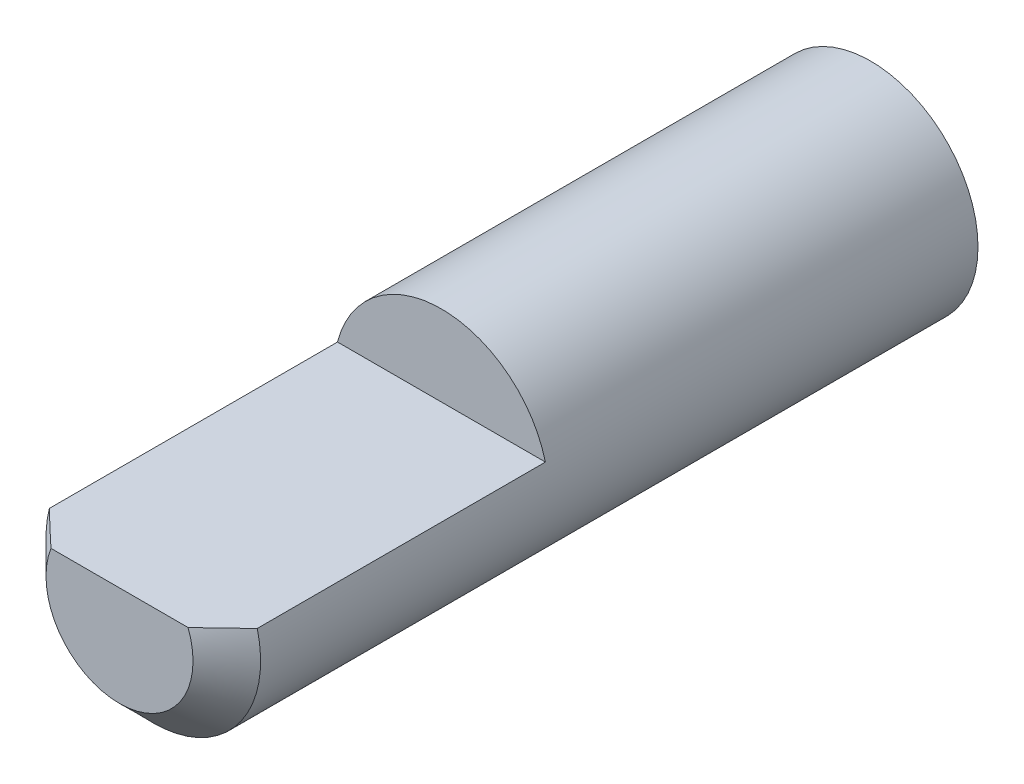
ISO-10303-21;
HEADER;
FILE_DESCRIPTION(('STEP AP214'),'2;1');
FILE_NAME('part.step','',(''),(''),'','','');
FILE_SCHEMA(('AUTOMOTIVE_DESIGN { 1 0 10303 214 1 1 1 1 }'));
ENDSEC;
DATA;
#1=APPLICATION_CONTEXT('core data for automotive mechanical design processes');
#2=APPLICATION_PROTOCOL_DEFINITION('international standard','automotive_design',2000,#1);
#3=PRODUCT_CONTEXT('',#1,'mechanical');
#4=PRODUCT('Part','Part','',(#3));
#5=PRODUCT_RELATED_PRODUCT_CATEGORY('part','',(#4));
#6=PRODUCT_DEFINITION_FORMATION('','',#4);
#7=PRODUCT_DEFINITION_CONTEXT('part definition',#1,'design');
#8=PRODUCT_DEFINITION('design','',#6,#7);
#9=PRODUCT_DEFINITION_SHAPE('','',#8);
#10=(LENGTH_UNIT() NAMED_UNIT(*) SI_UNIT(.MILLI.,.METRE.));
#11=(NAMED_UNIT(*) PLANE_ANGLE_UNIT() SI_UNIT($,.RADIAN.));
#12=(NAMED_UNIT(*) SI_UNIT($,.STERADIAN.) SOLID_ANGLE_UNIT());
#13=UNCERTAINTY_MEASURE_WITH_UNIT(LENGTH_MEASURE(1.E-05),#10,'distance_accuracy_value','');
#14=(GEOMETRIC_REPRESENTATION_CONTEXT(3) GLOBAL_UNCERTAINTY_ASSIGNED_CONTEXT((#13)) GLOBAL_UNIT_ASSIGNED_CONTEXT((#10,
#11,#12)) REPRESENTATION_CONTEXT('',''));
#15=CARTESIAN_POINT('',(0.,0.,0.));
#16=DIRECTION('',(0.,0.,1.));
#17=DIRECTION('',(1.,0.,0.));
#18=AXIS2_PLACEMENT_3D('',#15,#16,#17);
#19=CARTESIAN_POINT('',(0.,0.,22.225));
#20=DIRECTION('',(0.,0.,-1.));
#21=DIRECTION('',(-1.,0.,0.));
#22=AXIS2_PLACEMENT_3D('',#19,#20,#21);
#23=CYLINDRICAL_SURFACE('',#22,3.175);
#24=CARTESIAN_POINT('',(0.,0.,0.));
#25=DIRECTION('',(0.,0.,1.));
#26=DIRECTION('',(1.,0.,0.));
#27=AXIS2_PLACEMENT_3D('',#24,#25,#26);
#28=CIRCLE('',#27,3.175);
#29=CARTESIAN_POINT('',(3.175,0.,0.));
#30=VERTEX_POINT('',#29);
#31=EDGE_CURVE('E83',#30,#30,#28,.T.);
#32=ORIENTED_EDGE('',*,*,#31,.T.);
#33=EDGE_LOOP('',(#32));
#34=FACE_BOUND('',#33,.T.);
#35=DIRECTION('',(0.,0.,-1.));
#36=VECTOR('',#35,1.);
#37=CARTESIAN_POINT('',(3.07581310225443,0.7874,52.1884054149808));
#38=LINE('',#37,#36);
#39=CARTESIAN_POINT('',(3.07581310225443,0.7874,21.225));
#40=VERTEX_POINT('',#39);
#41=CARTESIAN_POINT('',(3.07581310225443,0.7874,12.7));
#42=VERTEX_POINT('',#41);
#43=EDGE_CURVE('E66',#40,#42,#38,.T.);
#44=ORIENTED_EDGE('',*,*,#43,.F.);
#45=CARTESIAN_POINT('',(0.,0.,21.225));
#46=DIRECTION('',(0.,0.,1.));
#47=DIRECTION('',(1.,0.,0.));
#48=AXIS2_PLACEMENT_3D('',#45,#46,#47);
#49=CIRCLE('',#48,3.175);
#50=CARTESIAN_POINT('',(-3.07581310225443,0.7874,21.225));
#51=VERTEX_POINT('',#50);
#52=EDGE_CURVE('E11',#40,#51,#49,.F.);
#53=ORIENTED_EDGE('',*,*,#52,.T.);
#54=DIRECTION('',(0.,0.,-1.));
#55=VECTOR('',#54,1.);
#56=CARTESIAN_POINT('',(-3.07581310225443,0.7874,52.1884054149808));
#57=LINE('',#56,#55);
#58=CARTESIAN_POINT('',(-3.07581310225443,0.7874,12.7));
#59=VERTEX_POINT('',#58);
#60=EDGE_CURVE('E71',#51,#59,#57,.T.);
#61=ORIENTED_EDGE('',*,*,#60,.T.);
#62=CARTESIAN_POINT('',(0.,0.,12.7));
#63=DIRECTION('',(0.,0.,1.));
#64=DIRECTION('',(1.,0.,0.));
#65=AXIS2_PLACEMENT_3D('',#62,#63,#64);
#66=CIRCLE('',#65,3.175);
#67=EDGE_CURVE('E76',#42,#59,#66,.T.);
#68=ORIENTED_EDGE('',*,*,#67,.F.);
#69=EDGE_LOOP('',(#44,#53,#61,#68));
#70=FACE_BOUND('',#69,.T.);
#71=ADVANCED_FACE('F35',(#34,#70),#23,.T.);
#72=CARTESIAN_POINT('',(0.,0.,22.225));
#73=DIRECTION('',(0.,0.,1.));
#74=DIRECTION('',(1.,0.,0.));
#75=AXIS2_PLACEMENT_3D('',#72,#73,#74);
#76=PLANE('',#75);
#77=DIRECTION('',(1.,0.,0.));
#78=VECTOR('',#77,1.);
#79=CARTESIAN_POINT('',(-3.07581310225443,0.7874,22.225));
#80=LINE('',#79,#78);
#81=CARTESIAN_POINT('',(-2.02746793809421,0.7874,22.225));
#82=VERTEX_POINT('',#81);
#83=CARTESIAN_POINT('',(2.02746793809421,0.7874,22.225));
#84=VERTEX_POINT('',#83);
#85=EDGE_CURVE('E81',#82,#84,#80,.T.);
#86=ORIENTED_EDGE('',*,*,#85,.F.);
#87=CARTESIAN_POINT('',(0.,0.,22.225));
#88=DIRECTION('',(0.,0.,1.));
#89=DIRECTION('',(1.,0.,0.));
#90=AXIS2_PLACEMENT_3D('',#87,#88,#89);
#91=CIRCLE('',#90,2.175);
#92=EDGE_CURVE('E86',#82,#84,#91,.T.);
#93=ORIENTED_EDGE('',*,*,#92,.T.);
#94=EDGE_LOOP('',(#86,#93));
#95=FACE_BOUND('',#94,.T.);
#96=ADVANCED_FACE('F104',(#95),#76,.T.);
#97=CARTESIAN_POINT('',(0.,0.,0.));
#98=DIRECTION('',(0.,0.,1.));
#99=DIRECTION('',(1.,0.,0.));
#100=AXIS2_PLACEMENT_3D('',#97,#98,#99);
#101=PLANE('',#100);
#102=ORIENTED_EDGE('',*,*,#31,.F.);
#103=EDGE_LOOP('',(#102));
#104=FACE_BOUND('',#103,.T.);
#105=ADVANCED_FACE('F100',(#104),#101,.F.);
#106=CARTESIAN_POINT('',(-3.07581310225443,0.7874,52.1884054149808));
#107=DIRECTION('',(0.,1.,0.));
#108=DIRECTION('',(0.,0.,1.));
#109=AXIS2_PLACEMENT_3D('',#106,#107,#108);
#110=PLANE('',#109);
#111=ORIENTED_EDGE('',*,*,#85,.T.);
#112=CARTESIAN_POINT('',(2.02746793809421,0.7874,22.225));
#113=CARTESIAN_POINT('',(2.11577280575199,0.7874,22.1426594626641));
#114=CARTESIAN_POINT('',(2.2037513641493,0.7874,22.0599712063815));
#115=CARTESIAN_POINT('',(2.37919847192681,0.7874,21.8940588982848));
#116=CARTESIAN_POINT('',(2.4666670324133,0.7874,21.8108348582222));
#117=CARTESIAN_POINT('',(2.6412396321889,0.7874,21.6440079379049));
#118=CARTESIAN_POINT('',(2.72834367551629,0.7874,21.5604050618686));
#119=CARTESIAN_POINT('',(2.90227010514607,0.7874,21.3929030033339));
#120=CARTESIAN_POINT('',(2.98909248533679,0.7874,21.3090038144873));
#121=CARTESIAN_POINT('',(3.07581310225443,0.7874,21.225));
#122=B_SPLINE_CURVE_WITH_KNOTS('',3,(#112,#113,#114,#115,#116,#117,#118,#119,#120,#121),
.UNSPECIFIED.,.F.,.F.,(4,2,2,2,4),(0.,0.362211506818016,0.724415096023692,1.0866146619016,
1.44882203509437),.UNSPECIFIED.);
#123=EDGE_CURVE('E44',#84,#40,#122,.T.);
#124=ORIENTED_EDGE('',*,*,#123,.T.);
#125=ORIENTED_EDGE('',*,*,#43,.T.);
#126=DIRECTION('',(1.,0.,0.));
#127=VECTOR('',#126,1.);
#128=CARTESIAN_POINT('',(-3.07581310225443,0.7874,12.7));
#129=LINE('',#128,#127);
#130=EDGE_CURVE('E69',#59,#42,#129,.T.);
#131=ORIENTED_EDGE('',*,*,#130,.F.);
#132=ORIENTED_EDGE('',*,*,#60,.F.);
#133=CARTESIAN_POINT('',(-3.07581310225443,0.7874,21.225));
#134=CARTESIAN_POINT('',(-2.98909248533679,0.7874,21.3090038144873));
#135=CARTESIAN_POINT('',(-2.90227010514608,0.7874,21.3929030033339));
#136=CARTESIAN_POINT('',(-2.7283436755163,0.7874,21.5604050618686));
#137=CARTESIAN_POINT('',(-2.6412396321889,0.7874,21.6440079379049));
#138=CARTESIAN_POINT('',(-2.4666670324133,0.7874,21.8108348582222));
#139=CARTESIAN_POINT('',(-2.37919847192681,0.7874,21.8940588982848));
#140=CARTESIAN_POINT('',(-2.20375136414931,0.7874,22.0599712063815));
#141=CARTESIAN_POINT('',(-2.115772805752,0.7874,22.1426594626641));
#142=CARTESIAN_POINT('',(-2.02746793809423,0.7874,22.225));
#143=B_SPLINE_CURVE_WITH_KNOTS('',3,(#133,#134,#135,#136,#137,#138,#139,#140,#141,#142),
.UNSPECIFIED.,.F.,.F.,(4,2,2,2,4),(0.,0.362207373192768,0.724406939070676,1.08661052827635,
1.44882203509437),.UNSPECIFIED.);
#144=EDGE_CURVE('E89',#51,#82,#143,.T.);
#145=ORIENTED_EDGE('',*,*,#144,.T.);
#146=EDGE_LOOP('',(#111,#124,#125,#131,#132,#145));
#147=FACE_BOUND('',#146,.T.);
#148=ADVANCED_FACE('F68',(#147),#110,.T.);
#149=CARTESIAN_POINT('',(0.,0.,12.7));
#150=DIRECTION('',(0.,0.,1.));
#151=DIRECTION('',(1.,0.,0.));
#152=AXIS2_PLACEMENT_3D('',#149,#150,#151);
#153=PLANE('',#152);
#154=ORIENTED_EDGE('',*,*,#130,.T.);
#155=ORIENTED_EDGE('',*,*,#67,.T.);
#156=EDGE_LOOP('',(#154,#155));
#157=FACE_BOUND('',#156,.T.);
#158=ADVANCED_FACE('F75',(#157),#153,.T.);
#159=CARTESIAN_POINT('',(0.,0.,22.225));
#160=DIRECTION('',(0.,0.,-1.));
#161=DIRECTION('',(-1.,0.,0.));
#162=AXIS2_PLACEMENT_3D('',#159,#160,#161);
#163=CONICAL_SURFACE('',#162,2.175,0.785398163397446);
#164=ORIENTED_EDGE('',*,*,#144,.F.);
#165=ORIENTED_EDGE('',*,*,#52,.F.);
#166=ORIENTED_EDGE('',*,*,#123,.F.);
#167=ORIENTED_EDGE('',*,*,#92,.F.);
#168=EDGE_LOOP('',(#164,#165,#166,#167));
#169=FACE_BOUND('',#168,.T.);
#170=ADVANCED_FACE('F37',(#169),#163,.T.);
#171=CLOSED_SHELL('',(#71,#96,#105,#148,#158,#170));
#172=MANIFOLD_SOLID_BREP('B2',#171);
#173=ADVANCED_BREP_SHAPE_REPRESENTATION('',(#18,#172),#14);
#174=SHAPE_DEFINITION_REPRESENTATION(#9,#173);
ENDSEC;
END-ISO-10303-21;
